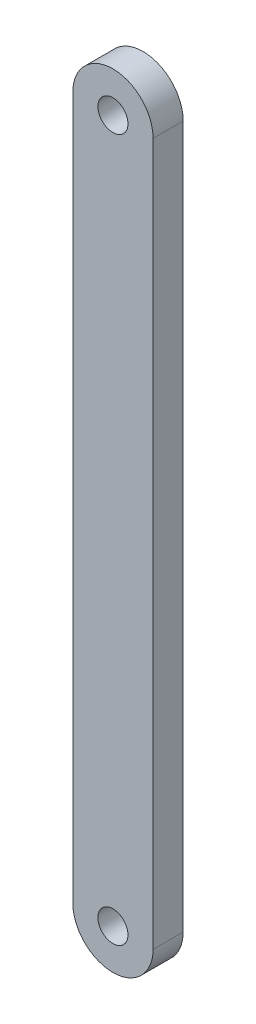
ISO-10303-21;
HEADER;
FILE_DESCRIPTION(('STEP AP214'),'2;1');
FILE_NAME('part.step','',(''),(''),'','','');
FILE_SCHEMA(('AUTOMOTIVE_DESIGN { 1 0 10303 214 1 1 1 1 }'));
ENDSEC;
DATA;
#1=APPLICATION_CONTEXT('core data for automotive mechanical design processes');
#2=APPLICATION_PROTOCOL_DEFINITION('international standard','automotive_design',2000,#1);
#3=PRODUCT_CONTEXT('',#1,'mechanical');
#4=PRODUCT('Part','Part','',(#3));
#5=PRODUCT_RELATED_PRODUCT_CATEGORY('part','',(#4));
#6=PRODUCT_DEFINITION_FORMATION('','',#4);
#7=PRODUCT_DEFINITION_CONTEXT('part definition',#1,'design');
#8=PRODUCT_DEFINITION('design','',#6,#7);
#9=PRODUCT_DEFINITION_SHAPE('','',#8);
#10=(LENGTH_UNIT() NAMED_UNIT(*) SI_UNIT(.MILLI.,.METRE.));
#11=(NAMED_UNIT(*) PLANE_ANGLE_UNIT() SI_UNIT($,.RADIAN.));
#12=(NAMED_UNIT(*) SI_UNIT($,.STERADIAN.) SOLID_ANGLE_UNIT());
#13=UNCERTAINTY_MEASURE_WITH_UNIT(LENGTH_MEASURE(1.E-05),#10,'distance_accuracy_value','');
#14=(GEOMETRIC_REPRESENTATION_CONTEXT(3) GLOBAL_UNCERTAINTY_ASSIGNED_CONTEXT((#13)) GLOBAL_UNIT_ASSIGNED_CONTEXT((#10,
#11,#12)) REPRESENTATION_CONTEXT('',''));
#15=CARTESIAN_POINT('',(0.,0.,0.));
#16=DIRECTION('',(0.,0.,1.));
#17=DIRECTION('',(1.,0.,0.));
#18=AXIS2_PLACEMENT_3D('',#15,#16,#17);
#19=CARTESIAN_POINT('',(4.,35.,3.));
#20=DIRECTION('',(-1.,0.,0.));
#21=DIRECTION('',(0.,-1.,0.));
#22=AXIS2_PLACEMENT_3D('',#19,#20,#21);
#23=PLANE('',#22);
#24=DIRECTION('',(0.,1.,0.));
#25=VECTOR('',#24,1.);
#26=CARTESIAN_POINT('',(4.,35.,0.));
#27=LINE('',#26,#25);
#28=CARTESIAN_POINT('',(4.,-35.,0.));
#29=VERTEX_POINT('',#28);
#30=CARTESIAN_POINT('',(4.,35.,0.));
#31=VERTEX_POINT('',#30);
#32=EDGE_CURVE('E76',#29,#31,#27,.T.);
#33=ORIENTED_EDGE('',*,*,#32,.T.);
#34=DIRECTION('',(0.,0.,-1.));
#35=VECTOR('',#34,1.);
#36=CARTESIAN_POINT('',(4.,35.,3.));
#37=LINE('',#36,#35);
#38=CARTESIAN_POINT('',(4.,35.,3.));
#39=VERTEX_POINT('',#38);
#40=EDGE_CURVE('E11',#39,#31,#37,.T.);
#41=ORIENTED_EDGE('',*,*,#40,.F.);
#42=DIRECTION('',(0.,1.,0.));
#43=VECTOR('',#42,1.);
#44=CARTESIAN_POINT('',(4.,35.,3.));
#45=LINE('',#44,#43);
#46=CARTESIAN_POINT('',(4.00000000000001,-35.,3.));
#47=VERTEX_POINT('',#46);
#48=EDGE_CURVE('E51',#47,#39,#45,.T.);
#49=ORIENTED_EDGE('',*,*,#48,.F.);
#50=DIRECTION('',(0.,0.,-1.));
#51=VECTOR('',#50,1.);
#52=CARTESIAN_POINT('',(4.00000000000001,-35.,3.));
#53=LINE('',#52,#51);
#54=EDGE_CURVE('E84',#47,#29,#53,.T.);
#55=ORIENTED_EDGE('',*,*,#54,.T.);
#56=EDGE_LOOP('',(#33,#41,#49,#55));
#57=FACE_BOUND('',#56,.T.);
#58=ADVANCED_FACE('F35',(#57),#23,.F.);
#59=CARTESIAN_POINT('',(-4.,35.,3.));
#60=DIRECTION('',(1.,0.,0.));
#61=DIRECTION('',(0.,1.,0.));
#62=AXIS2_PLACEMENT_3D('',#59,#60,#61);
#63=PLANE('',#62);
#64=DIRECTION('',(0.,-1.,0.));
#65=VECTOR('',#64,1.);
#66=CARTESIAN_POINT('',(-4.,35.,0.));
#67=LINE('',#66,#65);
#68=CARTESIAN_POINT('',(-4.,35.,0.));
#69=VERTEX_POINT('',#68);
#70=CARTESIAN_POINT('',(-3.99999999999999,-35.,0.));
#71=VERTEX_POINT('',#70);
#72=EDGE_CURVE('E81',#69,#71,#67,.T.);
#73=ORIENTED_EDGE('',*,*,#72,.T.);
#74=DIRECTION('',(0.,0.,-1.));
#75=VECTOR('',#74,1.);
#76=CARTESIAN_POINT('',(-3.99999999999999,-35.,3.));
#77=LINE('',#76,#75);
#78=CARTESIAN_POINT('',(-3.99999999999999,-35.,3.));
#79=VERTEX_POINT('',#78);
#80=EDGE_CURVE('E88',#79,#71,#77,.T.);
#81=ORIENTED_EDGE('',*,*,#80,.F.);
#82=DIRECTION('',(0.,-1.,0.));
#83=VECTOR('',#82,1.);
#84=CARTESIAN_POINT('',(-4.,35.,3.));
#85=LINE('',#84,#83);
#86=CARTESIAN_POINT('',(-4.,35.,3.));
#87=VERTEX_POINT('',#86);
#88=EDGE_CURVE('E89',#87,#79,#85,.T.);
#89=ORIENTED_EDGE('',*,*,#88,.F.);
#90=DIRECTION('',(0.,0.,-1.));
#91=VECTOR('',#90,1.);
#92=CARTESIAN_POINT('',(-4.,35.,3.));
#93=LINE('',#92,#91);
#94=EDGE_CURVE('E43',#87,#69,#93,.T.);
#95=ORIENTED_EDGE('',*,*,#94,.T.);
#96=EDGE_LOOP('',(#73,#81,#89,#95));
#97=FACE_BOUND('',#96,.T.);
#98=ADVANCED_FACE('F111',(#97),#63,.F.);
#99=CARTESIAN_POINT('',(0.,0.,3.));
#100=DIRECTION('',(0.,0.,1.));
#101=DIRECTION('',(1.,0.,0.));
#102=AXIS2_PLACEMENT_3D('',#99,#100,#101);
#103=PLANE('',#102);
#104=CARTESIAN_POINT('',(0.,35.,3.));
#105=DIRECTION('',(0.,0.,1.));
#106=DIRECTION('',(1.,0.,0.));
#107=AXIS2_PLACEMENT_3D('',#104,#105,#106);
#108=CIRCLE('',#107,1.5);
#109=CARTESIAN_POINT('',(1.5,35.,3.));
#110=VERTEX_POINT('',#109);
#111=EDGE_CURVE('E99',#110,#110,#108,.T.);
#112=ORIENTED_EDGE('',*,*,#111,.F.);
#113=EDGE_LOOP('',(#112));
#114=FACE_BOUND('',#113,.T.);
#115=CARTESIAN_POINT('',(0.,-35.,3.));
#116=DIRECTION('',(0.,0.,1.));
#117=DIRECTION('',(1.,0.,0.));
#118=AXIS2_PLACEMENT_3D('',#115,#116,#117);
#119=CIRCLE('',#118,1.5);
#120=CARTESIAN_POINT('',(1.5,-35.,3.));
#121=VERTEX_POINT('',#120);
#122=EDGE_CURVE('E192',#121,#121,#119,.T.);
#123=ORIENTED_EDGE('',*,*,#122,.F.);
#124=EDGE_LOOP('',(#123));
#125=FACE_BOUND('',#124,.T.);
#126=ORIENTED_EDGE('',*,*,#88,.T.);
#127=CARTESIAN_POINT('',(0.,-35.,3.));
#128=DIRECTION('',(0.,0.,1.));
#129=DIRECTION('',(1.,0.,0.));
#130=AXIS2_PLACEMENT_3D('',#127,#128,#129);
#131=CIRCLE('',#130,4.);
#132=EDGE_CURVE('E94',#79,#47,#131,.T.);
#133=ORIENTED_EDGE('',*,*,#132,.T.);
#134=ORIENTED_EDGE('',*,*,#48,.T.);
#135=CARTESIAN_POINT('',(0.,35.,3.));
#136=DIRECTION('',(0.,0.,1.));
#137=DIRECTION('',(1.,0.,0.));
#138=AXIS2_PLACEMENT_3D('',#135,#136,#137);
#139=CIRCLE('',#138,4.);
#140=EDGE_CURVE('E82',#39,#87,#139,.T.);
#141=ORIENTED_EDGE('',*,*,#140,.T.);
#142=EDGE_LOOP('',(#126,#133,#134,#141));
#143=FACE_BOUND('',#142,.T.);
#144=ADVANCED_FACE('F114',(#114,#125,#143),#103,.T.);
#145=CARTESIAN_POINT('',(0.,0.,0.));
#146=DIRECTION('',(0.,0.,1.));
#147=DIRECTION('',(1.,0.,0.));
#148=AXIS2_PLACEMENT_3D('',#145,#146,#147);
#149=PLANE('',#148);
#150=CARTESIAN_POINT('',(0.,35.,0.));
#151=DIRECTION('',(0.,0.,1.));
#152=DIRECTION('',(1.,0.,0.));
#153=AXIS2_PLACEMENT_3D('',#150,#151,#152);
#154=CIRCLE('',#153,1.5);
#155=CARTESIAN_POINT('',(1.5,35.,0.));
#156=VERTEX_POINT('',#155);
#157=EDGE_CURVE('E95',#156,#156,#154,.T.);
#158=ORIENTED_EDGE('',*,*,#157,.T.);
#159=EDGE_LOOP('',(#158));
#160=FACE_BOUND('',#159,.T.);
#161=CARTESIAN_POINT('',(0.,-35.,0.));
#162=DIRECTION('',(0.,0.,1.));
#163=DIRECTION('',(1.,0.,0.));
#164=AXIS2_PLACEMENT_3D('',#161,#162,#163);
#165=CIRCLE('',#164,1.5);
#166=CARTESIAN_POINT('',(1.5,-35.,0.));
#167=VERTEX_POINT('',#166);
#168=EDGE_CURVE('E189',#167,#167,#165,.T.);
#169=ORIENTED_EDGE('',*,*,#168,.T.);
#170=EDGE_LOOP('',(#169));
#171=FACE_BOUND('',#170,.T.);
#172=ORIENTED_EDGE('',*,*,#32,.F.);
#173=CARTESIAN_POINT('',(0.,-35.,0.));
#174=DIRECTION('',(0.,0.,1.));
#175=DIRECTION('',(1.,0.,0.));
#176=AXIS2_PLACEMENT_3D('',#173,#174,#175);
#177=CIRCLE('',#176,4.);
#178=EDGE_CURVE('E80',#71,#29,#177,.T.);
#179=ORIENTED_EDGE('',*,*,#178,.F.);
#180=ORIENTED_EDGE('',*,*,#72,.F.);
#181=CARTESIAN_POINT('',(0.,35.,0.));
#182=DIRECTION('',(0.,0.,1.));
#183=DIRECTION('',(1.,0.,0.));
#184=AXIS2_PLACEMENT_3D('',#181,#182,#183);
#185=CIRCLE('',#184,4.);
#186=EDGE_CURVE('E62',#31,#69,#185,.T.);
#187=ORIENTED_EDGE('',*,*,#186,.F.);
#188=EDGE_LOOP('',(#172,#179,#180,#187));
#189=FACE_BOUND('',#188,.T.);
#190=ADVANCED_FACE('F77',(#160,#171,#189),#149,.F.);
#191=CARTESIAN_POINT('',(0.,35.,3.));
#192=DIRECTION('',(0.,0.,-1.));
#193=DIRECTION('',(-1.,0.,0.));
#194=AXIS2_PLACEMENT_3D('',#191,#192,#193);
#195=CYLINDRICAL_SURFACE('',#194,4.);
#196=ORIENTED_EDGE('',*,*,#140,.F.);
#197=ORIENTED_EDGE('',*,*,#40,.T.);
#198=ORIENTED_EDGE('',*,*,#186,.T.);
#199=ORIENTED_EDGE('',*,*,#94,.F.);
#200=EDGE_LOOP('',(#196,#197,#198,#199));
#201=FACE_BOUND('',#200,.T.);
#202=ADVANCED_FACE('F112',(#201),#195,.T.);
#203=CARTESIAN_POINT('',(0.,-35.,3.));
#204=DIRECTION('',(0.,0.,-1.));
#205=DIRECTION('',(-1.,0.,0.));
#206=AXIS2_PLACEMENT_3D('',#203,#204,#205);
#207=CYLINDRICAL_SURFACE('',#206,4.);
#208=ORIENTED_EDGE('',*,*,#178,.T.);
#209=ORIENTED_EDGE('',*,*,#54,.F.);
#210=ORIENTED_EDGE('',*,*,#132,.F.);
#211=ORIENTED_EDGE('',*,*,#80,.T.);
#212=EDGE_LOOP('',(#208,#209,#210,#211));
#213=FACE_BOUND('',#212,.T.);
#214=ADVANCED_FACE('F92',(#213),#207,.T.);
#215=CARTESIAN_POINT('',(0.,-35.,0.));
#216=DIRECTION('',(0.,0.,1.));
#217=DIRECTION('',(1.,0.,0.));
#218=AXIS2_PLACEMENT_3D('',#215,#216,#217);
#219=CYLINDRICAL_SURFACE('',#218,1.5);
#220=ORIENTED_EDGE('',*,*,#168,.F.);
#221=EDGE_LOOP('',(#220));
#222=FACE_BOUND('',#221,.T.);
#223=ORIENTED_EDGE('',*,*,#122,.T.);
#224=EDGE_LOOP('',(#223));
#225=FACE_BOUND('',#224,.T.);
#226=ADVANCED_FACE('F151',(#222,#225),#219,.F.);
#227=CARTESIAN_POINT('',(0.,35.,0.));
#228=DIRECTION('',(0.,0.,1.));
#229=DIRECTION('',(1.,0.,0.));
#230=AXIS2_PLACEMENT_3D('',#227,#228,#229);
#231=CYLINDRICAL_SURFACE('',#230,1.5);
#232=ORIENTED_EDGE('',*,*,#157,.F.);
#233=EDGE_LOOP('',(#232));
#234=FACE_BOUND('',#233,.T.);
#235=ORIENTED_EDGE('',*,*,#111,.T.);
#236=EDGE_LOOP('',(#235));
#237=FACE_BOUND('',#236,.T.);
#238=ADVANCED_FACE('F172',(#234,#237),#231,.F.);
#239=CLOSED_SHELL('',(#58,#98,#144,#190,#202,#214,#226,#238));
#240=MANIFOLD_SOLID_BREP('B2',#239);
#241=ADVANCED_BREP_SHAPE_REPRESENTATION('',(#18,#240),#14);
#242=SHAPE_DEFINITION_REPRESENTATION(#9,#241);
ENDSEC;
END-ISO-10303-21;
